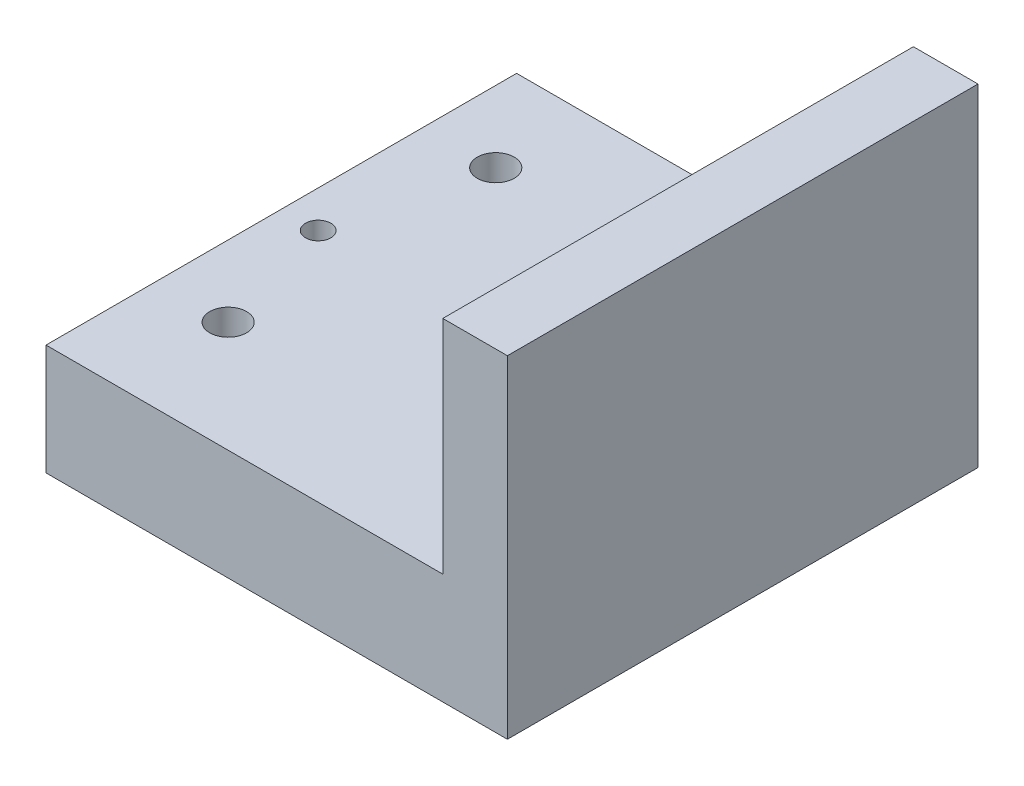
ISO-10303-21;
HEADER;
FILE_DESCRIPTION(('STEP AP214'),'2;1');
FILE_NAME('part.step','',(''),(''),'','','');
FILE_SCHEMA(('AUTOMOTIVE_DESIGN { 1 0 10303 214 1 1 1 1 }'));
ENDSEC;
DATA;
#1=APPLICATION_CONTEXT('core data for automotive mechanical design processes');
#2=APPLICATION_PROTOCOL_DEFINITION('international standard','automotive_design',2000,#1);
#3=PRODUCT_CONTEXT('',#1,'mechanical');
#4=PRODUCT('Part','Part','',(#3));
#5=PRODUCT_RELATED_PRODUCT_CATEGORY('part','',(#4));
#6=PRODUCT_DEFINITION_FORMATION('','',#4);
#7=PRODUCT_DEFINITION_CONTEXT('part definition',#1,'design');
#8=PRODUCT_DEFINITION('design','',#6,#7);
#9=PRODUCT_DEFINITION_SHAPE('','',#8);
#10=(LENGTH_UNIT() NAMED_UNIT(*) SI_UNIT(.MILLI.,.METRE.));
#11=(NAMED_UNIT(*) PLANE_ANGLE_UNIT() SI_UNIT($,.RADIAN.));
#12=(NAMED_UNIT(*) SI_UNIT($,.STERADIAN.) SOLID_ANGLE_UNIT());
#13=UNCERTAINTY_MEASURE_WITH_UNIT(LENGTH_MEASURE(1.E-05),#10,'distance_accuracy_value','');
#14=(GEOMETRIC_REPRESENTATION_CONTEXT(3) GLOBAL_UNCERTAINTY_ASSIGNED_CONTEXT((#13)) GLOBAL_UNIT_ASSIGNED_CONTEXT((#10,
#11,#12)) REPRESENTATION_CONTEXT('',''));
#15=CARTESIAN_POINT('',(0.,0.,0.));
#16=DIRECTION('',(0.,0.,1.));
#17=DIRECTION('',(1.,0.,0.));
#18=AXIS2_PLACEMENT_3D('',#15,#16,#17);
#19=CARTESIAN_POINT('',(-21.5,12.,-25.5));
#20=DIRECTION('',(1.,0.,0.));
#21=DIRECTION('',(0.,0.,-1.));
#22=AXIS2_PLACEMENT_3D('',#19,#20,#21);
#23=PLANE('',#22);
#24=DIRECTION('',(0.,0.,1.));
#25=VECTOR('',#24,1.);
#26=CARTESIAN_POINT('',(-21.5,0.,-25.5));
#27=LINE('',#26,#25);
#28=CARTESIAN_POINT('',(-21.5,0.,-25.5));
#29=VERTEX_POINT('',#28);
#30=CARTESIAN_POINT('',(-21.5,0.,25.5));
#31=VERTEX_POINT('',#30);
#32=EDGE_CURVE('E92',#29,#31,#27,.T.);
#33=ORIENTED_EDGE('',*,*,#32,.T.);
#34=DIRECTION('',(0.,-1.,0.));
#35=VECTOR('',#34,1.);
#36=CARTESIAN_POINT('',(-21.5,12.,25.5));
#37=LINE('',#36,#35);
#38=CARTESIAN_POINT('',(-21.5,12.,25.5));
#39=VERTEX_POINT('',#38);
#40=EDGE_CURVE('E11',#39,#31,#37,.T.);
#41=ORIENTED_EDGE('',*,*,#40,.F.);
#42=DIRECTION('',(0.,0.,1.));
#43=VECTOR('',#42,1.);
#44=CARTESIAN_POINT('',(-21.5,12.,-25.5));
#45=LINE('',#44,#43);
#46=CARTESIAN_POINT('',(-21.5,12.,-25.5));
#47=VERTEX_POINT('',#46);
#48=EDGE_CURVE('E84',#47,#39,#45,.T.);
#49=ORIENTED_EDGE('',*,*,#48,.F.);
#50=DIRECTION('',(0.,-1.,0.));
#51=VECTOR('',#50,1.);
#52=CARTESIAN_POINT('',(-21.5,12.,-25.5));
#53=LINE('',#52,#51);
#54=EDGE_CURVE('E41',#47,#29,#53,.T.);
#55=ORIENTED_EDGE('',*,*,#54,.T.);
#56=EDGE_LOOP('',(#33,#41,#49,#55));
#57=FACE_BOUND('',#56,.T.);
#58=ADVANCED_FACE('F33',(#57),#23,.F.);
#59=CARTESIAN_POINT('',(-21.5,12.,25.5));
#60=DIRECTION('',(0.,0.,-1.));
#61=DIRECTION('',(-1.,0.,0.));
#62=AXIS2_PLACEMENT_3D('',#59,#60,#61);
#63=PLANE('',#62);
#64=DIRECTION('',(1.,0.,0.));
#65=VECTOR('',#64,1.);
#66=CARTESIAN_POINT('',(-21.5,0.,25.5));
#67=LINE('',#66,#65);
#68=CARTESIAN_POINT('',(28.5,0.,25.5));
#69=VERTEX_POINT('',#68);
#70=EDGE_CURVE('E62',#31,#69,#67,.T.);
#71=ORIENTED_EDGE('',*,*,#70,.T.);
#72=DIRECTION('',(0.,1.,0.));
#73=VECTOR('',#72,1.);
#74=CARTESIAN_POINT('',(28.5,0.,25.5));
#75=LINE('',#74,#73);
#76=CARTESIAN_POINT('',(28.5,36.,25.5));
#77=VERTEX_POINT('',#76);
#78=EDGE_CURVE('E104',#69,#77,#75,.T.);
#79=ORIENTED_EDGE('',*,*,#78,.T.);
#80=DIRECTION('',(1.,0.,0.));
#81=VECTOR('',#80,1.);
#82=CARTESIAN_POINT('',(21.5,36.,25.5));
#83=LINE('',#82,#81);
#84=CARTESIAN_POINT('',(21.5,36.,25.5));
#85=VERTEX_POINT('',#84);
#86=EDGE_CURVE('E118',#85,#77,#83,.T.);
#87=ORIENTED_EDGE('',*,*,#86,.F.);
#88=DIRECTION('',(0.,1.,0.));
#89=VECTOR('',#88,1.);
#90=CARTESIAN_POINT('',(21.5,0.,25.5));
#91=LINE('',#90,#89);
#92=CARTESIAN_POINT('',(21.5,12.,25.5));
#93=VERTEX_POINT('',#92);
#94=EDGE_CURVE('E83',#93,#85,#91,.T.);
#95=ORIENTED_EDGE('',*,*,#94,.F.);
#96=DIRECTION('',(1.,0.,0.));
#97=VECTOR('',#96,1.);
#98=CARTESIAN_POINT('',(-21.5,12.,25.5));
#99=LINE('',#98,#97);
#100=EDGE_CURVE('E78',#39,#93,#99,.T.);
#101=ORIENTED_EDGE('',*,*,#100,.F.);
#102=ORIENTED_EDGE('',*,*,#40,.T.);
#103=EDGE_LOOP('',(#71,#79,#87,#95,#101,#102));
#104=FACE_BOUND('',#103,.T.);
#105=ADVANCED_FACE('F79',(#104),#63,.F.);
#106=CARTESIAN_POINT('',(-21.5,12.,-25.5));
#107=DIRECTION('',(0.,0.,1.));
#108=DIRECTION('',(1.,0.,0.));
#109=AXIS2_PLACEMENT_3D('',#106,#107,#108);
#110=PLANE('',#109);
#111=DIRECTION('',(-1.,0.,0.));
#112=VECTOR('',#111,1.);
#113=CARTESIAN_POINT('',(-21.5,0.,-25.5));
#114=LINE('',#113,#112);
#115=CARTESIAN_POINT('',(28.5,0.,-25.5));
#116=VERTEX_POINT('',#115);
#117=EDGE_CURVE('E90',#116,#29,#114,.T.);
#118=ORIENTED_EDGE('',*,*,#117,.T.);
#119=ORIENTED_EDGE('',*,*,#54,.F.);
#120=DIRECTION('',(-1.,0.,0.));
#121=VECTOR('',#120,1.);
#122=CARTESIAN_POINT('',(-21.5,12.,-25.5));
#123=LINE('',#122,#121);
#124=CARTESIAN_POINT('',(21.5,12.,-25.5));
#125=VERTEX_POINT('',#124);
#126=EDGE_CURVE('E49',#125,#47,#123,.T.);
#127=ORIENTED_EDGE('',*,*,#126,.F.);
#128=DIRECTION('',(0.,1.,0.));
#129=VECTOR('',#128,1.);
#130=CARTESIAN_POINT('',(21.5,0.,-25.5));
#131=LINE('',#130,#129);
#132=CARTESIAN_POINT('',(21.5,36.,-25.5));
#133=VERTEX_POINT('',#132);
#134=EDGE_CURVE('E93',#125,#133,#131,.T.);
#135=ORIENTED_EDGE('',*,*,#134,.T.);
#136=DIRECTION('',(-1.,0.,0.));
#137=VECTOR('',#136,1.);
#138=CARTESIAN_POINT('',(21.5,36.,-25.5));
#139=LINE('',#138,#137);
#140=CARTESIAN_POINT('',(28.5,36.,-25.5));
#141=VERTEX_POINT('',#140);
#142=EDGE_CURVE('E112',#141,#133,#139,.T.);
#143=ORIENTED_EDGE('',*,*,#142,.F.);
#144=DIRECTION('',(0.,1.,0.));
#145=VECTOR('',#144,1.);
#146=CARTESIAN_POINT('',(28.5,0.,-25.5));
#147=LINE('',#146,#145);
#148=EDGE_CURVE('E97',#116,#141,#147,.T.);
#149=ORIENTED_EDGE('',*,*,#148,.F.);
#150=EDGE_LOOP('',(#118,#119,#127,#135,#143,#149));
#151=FACE_BOUND('',#150,.T.);
#152=ADVANCED_FACE('F173',(#151),#110,.F.);
#153=CARTESIAN_POINT('',(0.,12.,0.));
#154=DIRECTION('',(0.,1.,0.));
#155=DIRECTION('',(0.,0.,1.));
#156=AXIS2_PLACEMENT_3D('',#153,#154,#155);
#157=PLANE('',#156);
#158=CARTESIAN_POINT('',(17.5,12.,0.));
#159=DIRECTION('',(0.,1.,0.));
#160=DIRECTION('',(0.,0.,1.));
#161=AXIS2_PLACEMENT_3D('',#158,#159,#160);
#162=CIRCLE('',#161,1.375);
#163=CARTESIAN_POINT('',(17.5,12.,1.375));
#164=VERTEX_POINT('',#163);
#165=EDGE_CURVE('E138',#164,#164,#162,.T.);
#166=ORIENTED_EDGE('',*,*,#165,.F.);
#167=EDGE_LOOP('',(#166));
#168=FACE_BOUND('',#167,.T.);
#169=CARTESIAN_POINT('',(-13.7749999999997,12.,13.4861869374338));
#170=DIRECTION('',(0.,1.,0.));
#171=DIRECTION('',(0.,0.,1.));
#172=AXIS2_PLACEMENT_3D('',#169,#170,#171);
#173=CIRCLE('',#172,2.00000000000001);
#174=CARTESIAN_POINT('',(-13.7749999999997,12.,15.4861869374338));
#175=VERTEX_POINT('',#174);
#176=EDGE_CURVE('E151',#175,#175,#173,.T.);
#177=ORIENTED_EDGE('',*,*,#176,.F.);
#178=EDGE_LOOP('',(#177));
#179=FACE_BOUND('',#178,.T.);
#180=CARTESIAN_POINT('',(13.775,12.,-15.5138130625664));
#181=DIRECTION('',(0.,1.,0.));
#182=DIRECTION('',(0.,0.,1.));
#183=AXIS2_PLACEMENT_3D('',#180,#181,#182);
#184=CIRCLE('',#183,2.);
#185=CARTESIAN_POINT('',(13.775,12.,-13.5138130625664));
#186=VERTEX_POINT('',#185);
#187=EDGE_CURVE('E132',#186,#186,#184,.T.);
#188=ORIENTED_EDGE('',*,*,#187,.F.);
#189=EDGE_LOOP('',(#188));
#190=FACE_BOUND('',#189,.T.);
#191=CARTESIAN_POINT('',(-17.5,12.,2.44403693719019E-13));
#192=DIRECTION('',(0.,1.,0.));
#193=DIRECTION('',(0.,0.,1.));
#194=AXIS2_PLACEMENT_3D('',#191,#192,#193);
#195=CIRCLE('',#194,1.375);
#196=CARTESIAN_POINT('',(-17.5,12.,1.37500000000025));
#197=VERTEX_POINT('',#196);
#198=EDGE_CURVE('E125',#197,#197,#195,.T.);
#199=ORIENTED_EDGE('',*,*,#198,.F.);
#200=EDGE_LOOP('',(#199));
#201=FACE_BOUND('',#200,.T.);
#202=CARTESIAN_POINT('',(-13.775,12.,-15.5138130625662));
#203=DIRECTION('',(0.,1.,0.));
#204=DIRECTION('',(0.,0.,1.));
#205=AXIS2_PLACEMENT_3D('',#202,#203,#204);
#206=CIRCLE('',#205,2.);
#207=CARTESIAN_POINT('',(-13.775,12.,-13.5138130625662));
#208=VERTEX_POINT('',#207);
#209=EDGE_CURVE('E146',#208,#208,#206,.T.);
#210=ORIENTED_EDGE('',*,*,#209,.F.);
#211=EDGE_LOOP('',(#210));
#212=FACE_BOUND('',#211,.T.);
#213=CARTESIAN_POINT('',(13.7750000000003,12.,13.4861869374336));
#214=DIRECTION('',(0.,1.,0.));
#215=DIRECTION('',(0.,0.,1.));
#216=AXIS2_PLACEMENT_3D('',#213,#214,#215);
#217=CIRCLE('',#216,2.00000000000001);
#218=CARTESIAN_POINT('',(13.7750000000003,12.,15.4861869374336));
#219=VERTEX_POINT('',#218);
#220=EDGE_CURVE('E139',#219,#219,#217,.T.);
#221=ORIENTED_EDGE('',*,*,#220,.F.);
#222=EDGE_LOOP('',(#221));
#223=FACE_BOUND('',#222,.T.);
#224=ORIENTED_EDGE('',*,*,#48,.T.);
#225=ORIENTED_EDGE('',*,*,#100,.T.);
#226=DIRECTION('',(0.,0.,-1.));
#227=VECTOR('',#226,1.);
#228=CARTESIAN_POINT('',(21.5,12.,-25.5));
#229=LINE('',#228,#227);
#230=EDGE_CURVE('E69',#93,#125,#229,.T.);
#231=ORIENTED_EDGE('',*,*,#230,.T.);
#232=ORIENTED_EDGE('',*,*,#126,.T.);
#233=EDGE_LOOP('',(#224,#225,#231,#232));
#234=FACE_BOUND('',#233,.T.);
#235=ADVANCED_FACE('F87',(#168,#179,#190,#201,#212,#223,#234),#157,.T.);
#236=CARTESIAN_POINT('',(0.,0.,0.));
#237=DIRECTION('',(0.,1.,0.));
#238=DIRECTION('',(0.,0.,1.));
#239=AXIS2_PLACEMENT_3D('',#236,#237,#238);
#240=PLANE('',#239);
#241=CARTESIAN_POINT('',(17.5,0.,0.));
#242=DIRECTION('',(0.,1.,0.));
#243=DIRECTION('',(0.,0.,1.));
#244=AXIS2_PLACEMENT_3D('',#241,#242,#243);
#245=CIRCLE('',#244,1.375);
#246=CARTESIAN_POINT('',(17.5,0.,1.375));
#247=VERTEX_POINT('',#246);
#248=EDGE_CURVE('E124',#247,#247,#245,.T.);
#249=ORIENTED_EDGE('',*,*,#248,.T.);
#250=EDGE_LOOP('',(#249));
#251=FACE_BOUND('',#250,.T.);
#252=CARTESIAN_POINT('',(-13.7749999999997,0.,13.4861869374338));
#253=DIRECTION('',(0.,1.,0.));
#254=DIRECTION('',(0.,0.,1.));
#255=AXIS2_PLACEMENT_3D('',#252,#253,#254);
#256=CIRCLE('',#255,2.00000000000001);
#257=CARTESIAN_POINT('',(-13.7749999999997,0.,15.4861869374338));
#258=VERTEX_POINT('',#257);
#259=EDGE_CURVE('E143',#258,#258,#256,.T.);
#260=ORIENTED_EDGE('',*,*,#259,.T.);
#261=EDGE_LOOP('',(#260));
#262=FACE_BOUND('',#261,.T.);
#263=CARTESIAN_POINT('',(13.775,0.,-15.5138130625664));
#264=DIRECTION('',(0.,1.,0.));
#265=DIRECTION('',(0.,0.,1.));
#266=AXIS2_PLACEMENT_3D('',#263,#264,#265);
#267=CIRCLE('',#266,2.);
#268=CARTESIAN_POINT('',(13.775,0.,-13.5138130625664));
#269=VERTEX_POINT('',#268);
#270=EDGE_CURVE('E135',#269,#269,#267,.T.);
#271=ORIENTED_EDGE('',*,*,#270,.T.);
#272=EDGE_LOOP('',(#271));
#273=FACE_BOUND('',#272,.T.);
#274=CARTESIAN_POINT('',(-17.5,0.,2.44403693719019E-13));
#275=DIRECTION('',(0.,1.,0.));
#276=DIRECTION('',(0.,0.,1.));
#277=AXIS2_PLACEMENT_3D('',#274,#275,#276);
#278=CIRCLE('',#277,1.375);
#279=CARTESIAN_POINT('',(-17.5,0.,1.37500000000025));
#280=VERTEX_POINT('',#279);
#281=EDGE_CURVE('E128',#280,#280,#278,.T.);
#282=ORIENTED_EDGE('',*,*,#281,.T.);
#283=EDGE_LOOP('',(#282));
#284=FACE_BOUND('',#283,.T.);
#285=CARTESIAN_POINT('',(-13.775,0.,-15.5138130625662));
#286=DIRECTION('',(0.,1.,0.));
#287=DIRECTION('',(0.,0.,1.));
#288=AXIS2_PLACEMENT_3D('',#285,#286,#287);
#289=CIRCLE('',#288,2.);
#290=CARTESIAN_POINT('',(-13.775,0.,-13.5138130625662));
#291=VERTEX_POINT('',#290);
#292=EDGE_CURVE('E129',#291,#291,#289,.T.);
#293=ORIENTED_EDGE('',*,*,#292,.T.);
#294=EDGE_LOOP('',(#293));
#295=FACE_BOUND('',#294,.T.);
#296=CARTESIAN_POINT('',(13.7750000000003,0.,13.4861869374336));
#297=DIRECTION('',(0.,1.,0.));
#298=DIRECTION('',(0.,0.,1.));
#299=AXIS2_PLACEMENT_3D('',#296,#297,#298);
#300=CIRCLE('',#299,2.00000000000001);
#301=CARTESIAN_POINT('',(13.7750000000003,0.,15.4861869374336));
#302=VERTEX_POINT('',#301);
#303=EDGE_CURVE('E142',#302,#302,#300,.T.);
#304=ORIENTED_EDGE('',*,*,#303,.T.);
#305=EDGE_LOOP('',(#304));
#306=FACE_BOUND('',#305,.T.);
#307=ORIENTED_EDGE('',*,*,#32,.F.);
#308=ORIENTED_EDGE('',*,*,#117,.F.);
#309=DIRECTION('',(0.,0.,-1.));
#310=VECTOR('',#309,1.);
#311=CARTESIAN_POINT('',(28.5,0.,-25.5));
#312=LINE('',#311,#310);
#313=EDGE_CURVE('E105',#69,#116,#312,.T.);
#314=ORIENTED_EDGE('',*,*,#313,.F.);
#315=ORIENTED_EDGE('',*,*,#70,.F.);
#316=EDGE_LOOP('',(#307,#308,#314,#315));
#317=FACE_BOUND('',#316,.T.);
#318=ADVANCED_FACE('F161',(#251,#262,#273,#284,#295,#306,#317),#240,.F.);
#319=CARTESIAN_POINT('',(21.5,0.,-25.5));
#320=DIRECTION('',(-1.,0.,0.));
#321=DIRECTION('',(0.,0.,1.));
#322=AXIS2_PLACEMENT_3D('',#319,#320,#321);
#323=PLANE('',#322);
#324=ORIENTED_EDGE('',*,*,#230,.F.);
#325=ORIENTED_EDGE('',*,*,#94,.T.);
#326=DIRECTION('',(0.,0.,1.));
#327=VECTOR('',#326,1.);
#328=CARTESIAN_POINT('',(21.5,36.,-25.5));
#329=LINE('',#328,#327);
#330=EDGE_CURVE('E121',#133,#85,#329,.T.);
#331=ORIENTED_EDGE('',*,*,#330,.F.);
#332=ORIENTED_EDGE('',*,*,#134,.F.);
#333=EDGE_LOOP('',(#324,#325,#331,#332));
#334=FACE_BOUND('',#333,.T.);
#335=ADVANCED_FACE('F214',(#334),#323,.T.);
#336=CARTESIAN_POINT('',(28.5,0.,-25.5));
#337=DIRECTION('',(1.,0.,0.));
#338=DIRECTION('',(0.,0.,-1.));
#339=AXIS2_PLACEMENT_3D('',#336,#337,#338);
#340=PLANE('',#339);
#341=ORIENTED_EDGE('',*,*,#148,.T.);
#342=DIRECTION('',(0.,0.,-1.));
#343=VECTOR('',#342,1.);
#344=CARTESIAN_POINT('',(28.5,36.,-25.5));
#345=LINE('',#344,#343);
#346=EDGE_CURVE('E115',#77,#141,#345,.T.);
#347=ORIENTED_EDGE('',*,*,#346,.F.);
#348=ORIENTED_EDGE('',*,*,#78,.F.);
#349=ORIENTED_EDGE('',*,*,#313,.T.);
#350=EDGE_LOOP('',(#341,#347,#348,#349));
#351=FACE_BOUND('',#350,.T.);
#352=ADVANCED_FACE('F198',(#351),#340,.T.);
#353=CARTESIAN_POINT('',(0.,36.,0.));
#354=DIRECTION('',(0.,1.,0.));
#355=DIRECTION('',(0.,0.,1.));
#356=AXIS2_PLACEMENT_3D('',#353,#354,#355);
#357=PLANE('',#356);
#358=ORIENTED_EDGE('',*,*,#330,.T.);
#359=ORIENTED_EDGE('',*,*,#86,.T.);
#360=ORIENTED_EDGE('',*,*,#346,.T.);
#361=ORIENTED_EDGE('',*,*,#142,.T.);
#362=EDGE_LOOP('',(#358,#359,#360,#361));
#363=FACE_BOUND('',#362,.T.);
#364=ADVANCED_FACE('F188',(#363),#357,.T.);
#365=CARTESIAN_POINT('',(13.7750000000003,0.,13.4861869374336));
#366=DIRECTION('',(0.,1.,0.));
#367=DIRECTION('',(0.,0.,1.));
#368=AXIS2_PLACEMENT_3D('',#365,#366,#367);
#369=CYLINDRICAL_SURFACE('',#368,2.00000000000001);
#370=ORIENTED_EDGE('',*,*,#303,.F.);
#371=EDGE_LOOP('',(#370));
#372=FACE_BOUND('',#371,.T.);
#373=ORIENTED_EDGE('',*,*,#220,.T.);
#374=EDGE_LOOP('',(#373));
#375=FACE_BOUND('',#374,.T.);
#376=ADVANCED_FACE('F185',(#372,#375),#369,.F.);
#377=CARTESIAN_POINT('',(-13.775,0.,-15.5138130625662));
#378=DIRECTION('',(0.,1.,0.));
#379=DIRECTION('',(0.,0.,1.));
#380=AXIS2_PLACEMENT_3D('',#377,#378,#379);
#381=CYLINDRICAL_SURFACE('',#380,2.);
#382=ORIENTED_EDGE('',*,*,#292,.F.);
#383=EDGE_LOOP('',(#382));
#384=FACE_BOUND('',#383,.T.);
#385=ORIENTED_EDGE('',*,*,#209,.T.);
#386=EDGE_LOOP('',(#385));
#387=FACE_BOUND('',#386,.T.);
#388=ADVANCED_FACE('F187',(#384,#387),#381,.F.);
#389=CARTESIAN_POINT('',(-17.5,0.,2.44403693719019E-13));
#390=DIRECTION('',(0.,1.,0.));
#391=DIRECTION('',(0.,0.,1.));
#392=AXIS2_PLACEMENT_3D('',#389,#390,#391);
#393=CYLINDRICAL_SURFACE('',#392,1.375);
#394=ORIENTED_EDGE('',*,*,#281,.F.);
#395=EDGE_LOOP('',(#394));
#396=FACE_BOUND('',#395,.T.);
#397=ORIENTED_EDGE('',*,*,#198,.T.);
#398=EDGE_LOOP('',(#397));
#399=FACE_BOUND('',#398,.T.);
#400=ADVANCED_FACE('F195',(#396,#399),#393,.F.);
#401=CARTESIAN_POINT('',(13.775,0.,-15.5138130625664));
#402=DIRECTION('',(0.,1.,0.));
#403=DIRECTION('',(0.,0.,1.));
#404=AXIS2_PLACEMENT_3D('',#401,#402,#403);
#405=CYLINDRICAL_SURFACE('',#404,2.);
#406=ORIENTED_EDGE('',*,*,#270,.F.);
#407=EDGE_LOOP('',(#406));
#408=FACE_BOUND('',#407,.T.);
#409=ORIENTED_EDGE('',*,*,#187,.T.);
#410=EDGE_LOOP('',(#409));
#411=FACE_BOUND('',#410,.T.);
#412=ADVANCED_FACE('F222',(#408,#411),#405,.F.);
#413=CARTESIAN_POINT('',(-13.7749999999997,0.,13.4861869374338));
#414=DIRECTION('',(0.,1.,0.));
#415=DIRECTION('',(0.,0.,1.));
#416=AXIS2_PLACEMENT_3D('',#413,#414,#415);
#417=CYLINDRICAL_SURFACE('',#416,2.00000000000001);
#418=ORIENTED_EDGE('',*,*,#259,.F.);
#419=EDGE_LOOP('',(#418));
#420=FACE_BOUND('',#419,.T.);
#421=ORIENTED_EDGE('',*,*,#176,.T.);
#422=EDGE_LOOP('',(#421));
#423=FACE_BOUND('',#422,.T.);
#424=ADVANCED_FACE('F167',(#420,#423),#417,.F.);
#425=CARTESIAN_POINT('',(17.5,0.,0.));
#426=DIRECTION('',(0.,1.,0.));
#427=DIRECTION('',(0.,0.,1.));
#428=AXIS2_PLACEMENT_3D('',#425,#426,#427);
#429=CYLINDRICAL_SURFACE('',#428,1.375);
#430=ORIENTED_EDGE('',*,*,#248,.F.);
#431=EDGE_LOOP('',(#430));
#432=FACE_BOUND('',#431,.T.);
#433=ORIENTED_EDGE('',*,*,#165,.T.);
#434=EDGE_LOOP('',(#433));
#435=FACE_BOUND('',#434,.T.);
#436=ADVANCED_FACE('F164',(#432,#435),#429,.F.);
#437=CLOSED_SHELL('',(#58,#105,#152,#235,#318,#335,#352,#364,#376,#388,#400,#412,#424,#436));
#438=MANIFOLD_SOLID_BREP('B2',#437);
#439=ADVANCED_BREP_SHAPE_REPRESENTATION('',(#18,#438),#14);
#440=SHAPE_DEFINITION_REPRESENTATION(#9,#439);
ENDSEC;
END-ISO-10303-21;
